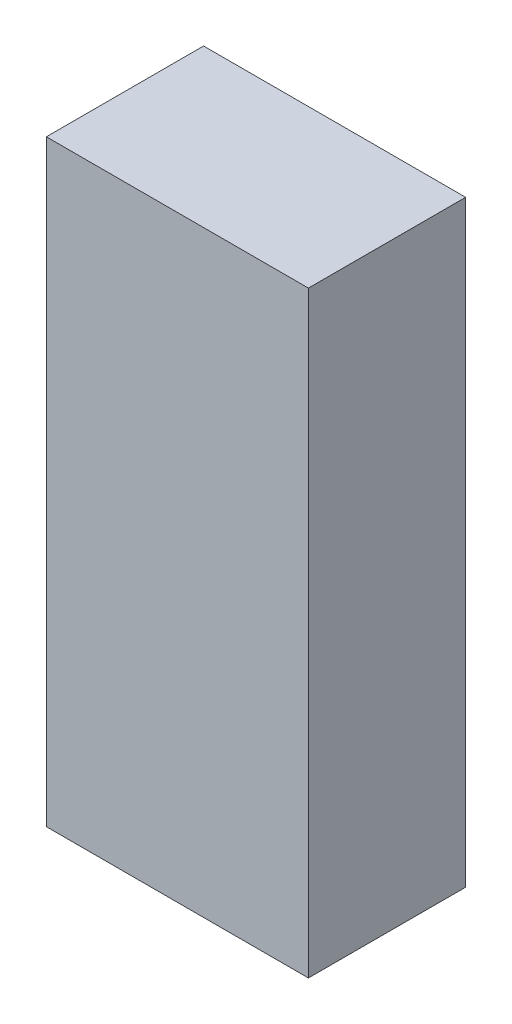
ISO-10303-21;
HEADER;
FILE_DESCRIPTION(('STEP AP214'),'2;1');
FILE_NAME('part.step','',(''),(''),'','','');
FILE_SCHEMA(('AUTOMOTIVE_DESIGN { 1 0 10303 214 1 1 1 1 }'));
ENDSEC;
DATA;
#1=APPLICATION_CONTEXT('core data for automotive mechanical design processes');
#2=APPLICATION_PROTOCOL_DEFINITION('international standard','automotive_design',2000,#1);
#3=PRODUCT_CONTEXT('',#1,'mechanical');
#4=PRODUCT('Part','Part','',(#3));
#5=PRODUCT_RELATED_PRODUCT_CATEGORY('part','',(#4));
#6=PRODUCT_DEFINITION_FORMATION('','',#4);
#7=PRODUCT_DEFINITION_CONTEXT('part definition',#1,'design');
#8=PRODUCT_DEFINITION('design','',#6,#7);
#9=PRODUCT_DEFINITION_SHAPE('','',#8);
#10=(LENGTH_UNIT() NAMED_UNIT(*) SI_UNIT(.MILLI.,.METRE.));
#11=(NAMED_UNIT(*) PLANE_ANGLE_UNIT() SI_UNIT($,.RADIAN.));
#12=(NAMED_UNIT(*) SI_UNIT($,.STERADIAN.) SOLID_ANGLE_UNIT());
#13=UNCERTAINTY_MEASURE_WITH_UNIT(LENGTH_MEASURE(1.E-05),#10,'distance_accuracy_value','');
#14=(GEOMETRIC_REPRESENTATION_CONTEXT(3) GLOBAL_UNCERTAINTY_ASSIGNED_CONTEXT((#13)) GLOBAL_UNIT_ASSIGNED_CONTEXT((#10,
#11,#12)) REPRESENTATION_CONTEXT('',''));
#15=CARTESIAN_POINT('',(0.,0.,0.));
#16=DIRECTION('',(0.,0.,1.));
#17=DIRECTION('',(1.,0.,0.));
#18=AXIS2_PLACEMENT_3D('',#15,#16,#17);
#19=CARTESIAN_POINT('',(-0.635,1.4478,0.762));
#20=DIRECTION('',(0.,0.,-1.));
#21=DIRECTION('',(-1.,0.,0.));
#22=AXIS2_PLACEMENT_3D('',#19,#20,#21);
#23=PLANE('',#22);
#24=DIRECTION('',(1.,0.,0.));
#25=VECTOR('',#24,1.);
#26=CARTESIAN_POINT('',(-0.635,-1.4478,0.762));
#27=LINE('',#26,#25);
#28=CARTESIAN_POINT('',(-0.635,-1.4478,0.762));
#29=VERTEX_POINT('',#28);
#30=CARTESIAN_POINT('',(0.635,-1.4478,0.762));
#31=VERTEX_POINT('',#30);
#32=EDGE_CURVE('E55',#29,#31,#27,.T.);
#33=ORIENTED_EDGE('',*,*,#32,.T.);
#34=DIRECTION('',(0.,1.,0.));
#35=VECTOR('',#34,1.);
#36=CARTESIAN_POINT('',(0.635,-1.4478,0.762));
#37=LINE('',#36,#35);
#38=CARTESIAN_POINT('',(0.635,1.4478,0.762));
#39=VERTEX_POINT('',#38);
#40=EDGE_CURVE('E57',#31,#39,#37,.T.);
#41=ORIENTED_EDGE('',*,*,#40,.T.);
#42=DIRECTION('',(1.,0.,0.));
#43=VECTOR('',#42,1.);
#44=CARTESIAN_POINT('',(0.635,1.4478,0.762));
#45=LINE('',#44,#43);
#46=CARTESIAN_POINT('',(-0.635,1.4478,0.762));
#47=VERTEX_POINT('',#46);
#48=EDGE_CURVE('E20',#39,#47,#45,.F.);
#49=ORIENTED_EDGE('',*,*,#48,.T.);
#50=DIRECTION('',(0.,1.,0.));
#51=VECTOR('',#50,1.);
#52=CARTESIAN_POINT('',(-0.635,1.4478,0.762));
#53=LINE('',#52,#51);
#54=EDGE_CURVE('E80',#47,#29,#53,.F.);
#55=ORIENTED_EDGE('',*,*,#54,.T.);
#56=EDGE_LOOP('',(#33,#41,#49,#55));
#57=FACE_BOUND('',#56,.T.);
#58=ADVANCED_FACE('F17',(#57),#23,.F.);
#59=CARTESIAN_POINT('',(0.635,1.4478,0.));
#60=DIRECTION('',(0.,-1.,0.));
#61=DIRECTION('',(0.,0.,-1.));
#62=AXIS2_PLACEMENT_3D('',#59,#60,#61);
#63=PLANE('',#62);
#64=DIRECTION('',(0.,0.,1.));
#65=VECTOR('',#64,1.);
#66=CARTESIAN_POINT('',(0.635,1.4478,0.));
#67=LINE('',#66,#65);
#68=CARTESIAN_POINT('',(0.635,1.4478,0.));
#69=VERTEX_POINT('',#68);
#70=EDGE_CURVE('E63',#39,#69,#67,.F.);
#71=ORIENTED_EDGE('',*,*,#70,.T.);
#72=DIRECTION('',(-1.,0.,0.));
#73=VECTOR('',#72,1.);
#74=CARTESIAN_POINT('',(-0.635,1.4478,0.));
#75=LINE('',#74,#73);
#76=CARTESIAN_POINT('',(-0.635,1.4478,0.));
#77=VERTEX_POINT('',#76);
#78=EDGE_CURVE('E83',#77,#69,#75,.F.);
#79=ORIENTED_EDGE('',*,*,#78,.F.);
#80=DIRECTION('',(0.,0.,-1.));
#81=VECTOR('',#80,1.);
#82=CARTESIAN_POINT('',(-0.635,1.4478,0.));
#83=LINE('',#82,#81);
#84=EDGE_CURVE('E69',#77,#47,#83,.F.);
#85=ORIENTED_EDGE('',*,*,#84,.T.);
#86=ORIENTED_EDGE('',*,*,#48,.F.);
#87=EDGE_LOOP('',(#71,#79,#85,#86));
#88=FACE_BOUND('',#87,.T.);
#89=ADVANCED_FACE('F66',(#88),#63,.F.);
#90=CARTESIAN_POINT('',(0.635,-1.4478,0.));
#91=DIRECTION('',(-1.,0.,0.));
#92=DIRECTION('',(0.,0.,1.));
#93=AXIS2_PLACEMENT_3D('',#90,#91,#92);
#94=PLANE('',#93);
#95=ORIENTED_EDGE('',*,*,#70,.F.);
#96=ORIENTED_EDGE('',*,*,#40,.F.);
#97=DIRECTION('',(0.,0.,1.));
#98=VECTOR('',#97,1.);
#99=CARTESIAN_POINT('',(0.635,-1.4478,0.));
#100=LINE('',#99,#98);
#101=CARTESIAN_POINT('',(0.635,-1.4478,0.));
#102=VERTEX_POINT('',#101);
#103=EDGE_CURVE('E75',#31,#102,#100,.F.);
#104=ORIENTED_EDGE('',*,*,#103,.T.);
#105=DIRECTION('',(0.,1.,0.));
#106=VECTOR('',#105,1.);
#107=CARTESIAN_POINT('',(0.635,1.4478,0.));
#108=LINE('',#107,#106);
#109=EDGE_CURVE('E73',#69,#102,#108,.F.);
#110=ORIENTED_EDGE('',*,*,#109,.F.);
#111=EDGE_LOOP('',(#95,#96,#104,#110));
#112=FACE_BOUND('',#111,.T.);
#113=ADVANCED_FACE('F71',(#112),#94,.F.);
#114=CARTESIAN_POINT('',(-0.635,-1.4478,0.));
#115=DIRECTION('',(0.,1.,0.));
#116=DIRECTION('',(0.,0.,1.));
#117=AXIS2_PLACEMENT_3D('',#114,#115,#116);
#118=PLANE('',#117);
#119=ORIENTED_EDGE('',*,*,#103,.F.);
#120=ORIENTED_EDGE('',*,*,#32,.F.);
#121=DIRECTION('',(0.,0.,-1.));
#122=VECTOR('',#121,1.);
#123=CARTESIAN_POINT('',(-0.635,-1.4478,0.));
#124=LINE('',#123,#122);
#125=CARTESIAN_POINT('',(-0.635,-1.4478,0.));
#126=VERTEX_POINT('',#125);
#127=EDGE_CURVE('E35',#29,#126,#124,.T.);
#128=ORIENTED_EDGE('',*,*,#127,.T.);
#129=DIRECTION('',(-1.,0.,0.));
#130=VECTOR('',#129,1.);
#131=CARTESIAN_POINT('',(-0.635,-1.4478,0.));
#132=LINE('',#131,#130);
#133=EDGE_CURVE('E26',#102,#126,#132,.T.);
#134=ORIENTED_EDGE('',*,*,#133,.F.);
#135=EDGE_LOOP('',(#119,#120,#128,#134));
#136=FACE_BOUND('',#135,.T.);
#137=ADVANCED_FACE('F89',(#136),#118,.F.);
#138=CARTESIAN_POINT('',(-0.635,1.4478,0.));
#139=DIRECTION('',(1.,0.,0.));
#140=DIRECTION('',(0.,0.,-1.));
#141=AXIS2_PLACEMENT_3D('',#138,#139,#140);
#142=PLANE('',#141);
#143=ORIENTED_EDGE('',*,*,#127,.F.);
#144=ORIENTED_EDGE('',*,*,#54,.F.);
#145=ORIENTED_EDGE('',*,*,#84,.F.);
#146=DIRECTION('',(0.,1.,0.));
#147=VECTOR('',#146,1.);
#148=CARTESIAN_POINT('',(-0.635,1.4478,0.));
#149=LINE('',#148,#147);
#150=EDGE_CURVE('E11',#126,#77,#149,.T.);
#151=ORIENTED_EDGE('',*,*,#150,.F.);
#152=EDGE_LOOP('',(#143,#144,#145,#151));
#153=FACE_BOUND('',#152,.T.);
#154=ADVANCED_FACE('F91',(#153),#142,.F.);
#155=CARTESIAN_POINT('',(-0.635,1.4478,0.));
#156=DIRECTION('',(0.,0.,-1.));
#157=DIRECTION('',(-1.,0.,0.));
#158=AXIS2_PLACEMENT_3D('',#155,#156,#157);
#159=PLANE('',#158);
#160=ORIENTED_EDGE('',*,*,#133,.T.);
#161=ORIENTED_EDGE('',*,*,#150,.T.);
#162=ORIENTED_EDGE('',*,*,#78,.T.);
#163=ORIENTED_EDGE('',*,*,#109,.T.);
#164=EDGE_LOOP('',(#160,#161,#162,#163));
#165=FACE_BOUND('',#164,.T.);
#166=ADVANCED_FACE('F88',(#165),#159,.T.);
#167=CLOSED_SHELL('',(#58,#89,#113,#137,#154,#166));
#168=MANIFOLD_SOLID_BREP('B1',#167);
#169=ADVANCED_BREP_SHAPE_REPRESENTATION('',(#18,#168),#14);
#170=SHAPE_DEFINITION_REPRESENTATION(#9,#169);
ENDSEC;
END-ISO-10303-21;
